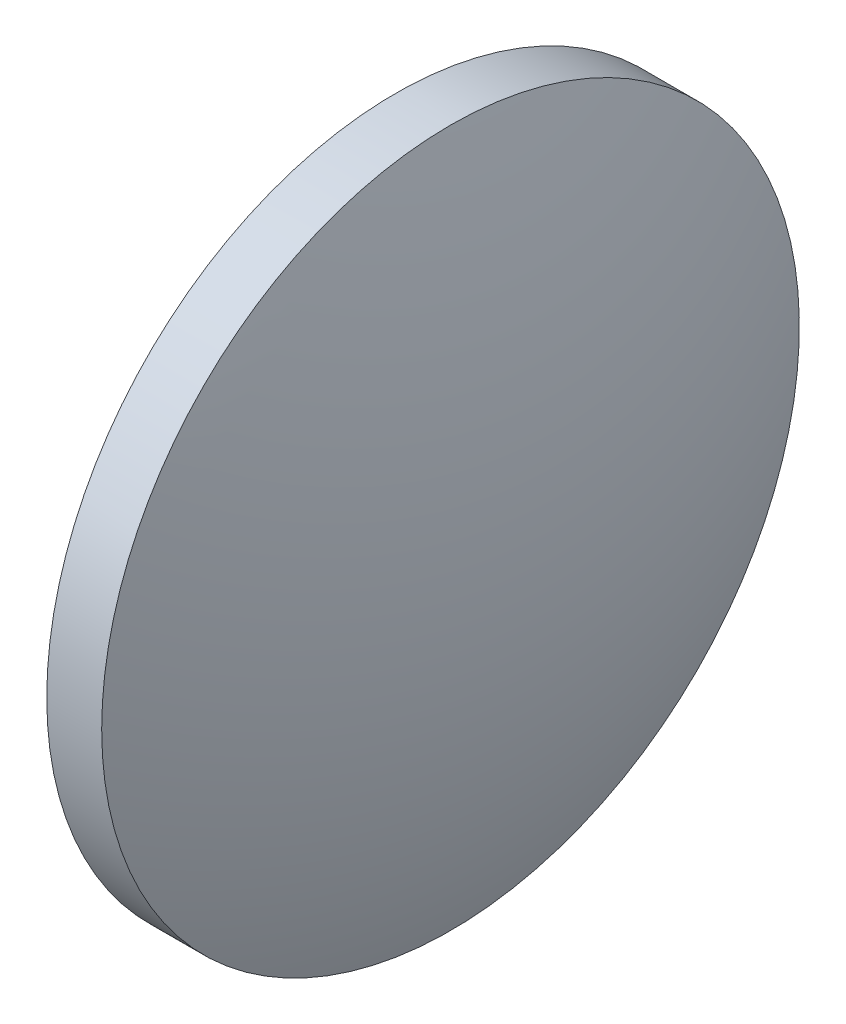
ISO-10303-21;
HEADER;
FILE_DESCRIPTION(('STEP AP214'),'2;1');
FILE_NAME('part.step','',(''),(''),'','','');
FILE_SCHEMA(('AUTOMOTIVE_DESIGN { 1 0 10303 214 1 1 1 1 }'));
ENDSEC;
DATA;
#1=APPLICATION_CONTEXT('core data for automotive mechanical design processes');
#2=APPLICATION_PROTOCOL_DEFINITION('international standard','automotive_design',2000,#1);
#3=PRODUCT_CONTEXT('',#1,'mechanical');
#4=PRODUCT('Part','Part','',(#3));
#5=PRODUCT_RELATED_PRODUCT_CATEGORY('part','',(#4));
#6=PRODUCT_DEFINITION_FORMATION('','',#4);
#7=PRODUCT_DEFINITION_CONTEXT('part definition',#1,'design');
#8=PRODUCT_DEFINITION('design','',#6,#7);
#9=PRODUCT_DEFINITION_SHAPE('','',#8);
#10=(LENGTH_UNIT() NAMED_UNIT(*) SI_UNIT(.MILLI.,.METRE.));
#11=(NAMED_UNIT(*) PLANE_ANGLE_UNIT() SI_UNIT($,.RADIAN.));
#12=(NAMED_UNIT(*) SI_UNIT($,.STERADIAN.) SOLID_ANGLE_UNIT());
#13=UNCERTAINTY_MEASURE_WITH_UNIT(LENGTH_MEASURE(1.E-05),#10,'distance_accuracy_value','');
#14=(GEOMETRIC_REPRESENTATION_CONTEXT(3) GLOBAL_UNCERTAINTY_ASSIGNED_CONTEXT((#13)) GLOBAL_UNIT_ASSIGNED_CONTEXT((#10,
#11,#12)) REPRESENTATION_CONTEXT('',''));
#15=CARTESIAN_POINT('',(0.,0.,0.));
#16=DIRECTION('',(0.,0.,1.));
#17=DIRECTION('',(1.,0.,0.));
#18=AXIS2_PLACEMENT_3D('',#15,#16,#17);
#19=CARTESIAN_POINT('',(521.377021174329,132.59316259993,0.));
#20=DIRECTION('',(-1.,0.,0.));
#21=DIRECTION('',(0.,1.,0.));
#22=AXIS2_PLACEMENT_3D('',#19,#20,#21);
#23=SPHERICAL_SURFACE('',#22,34.2712295081967);
#24=CARTESIAN_POINT('',(553.208250682525,132.59316259993,0.));
#25=DIRECTION('',(-1.,0.,0.));
#26=DIRECTION('',(0.,0.,1.));
#27=AXIS2_PLACEMENT_3D('',#24,#25,#26);
#28=CIRCLE('',#27,12.7);
#29=CARTESIAN_POINT('',(553.208250682525,132.59316259993,12.7));
#30=VERTEX_POINT('',#29);
#31=EDGE_CURVE('E10',#30,#30,#28,.T.);
#32=ORIENTED_EDGE('',*,*,#31,.F.);
#33=EDGE_LOOP('',(#32));
#34=FACE_BOUND('',#33,.T.);
#35=ADVANCED_FACE('F35',(#34),#23,.T.);
#36=CARTESIAN_POINT('',(545.503577135071,132.59316259993,0.));
#37=DIRECTION('',(-1.,0.,0.));
#38=DIRECTION('',(0.,0.,1.));
#39=AXIS2_PLACEMENT_3D('',#36,#37,#38);
#40=CYLINDRICAL_SURFACE('',#39,12.7);
#41=CARTESIAN_POINT('',(551.208250682525,132.59316259993,0.));
#42=DIRECTION('',(-1.,0.,0.));
#43=DIRECTION('',(0.,0.,1.));
#44=AXIS2_PLACEMENT_3D('',#41,#42,#43);
#45=CIRCLE('',#44,12.7);
#46=CARTESIAN_POINT('',(551.208250682525,132.59316259993,12.7));
#47=VERTEX_POINT('',#46);
#48=EDGE_CURVE('E41',#47,#47,#45,.T.);
#49=ORIENTED_EDGE('',*,*,#48,.F.);
#50=EDGE_LOOP('',(#49));
#51=FACE_BOUND('',#50,.T.);
#52=ORIENTED_EDGE('',*,*,#31,.T.);
#53=EDGE_LOOP('',(#52));
#54=FACE_BOUND('',#53,.T.);
#55=ADVANCED_FACE('F49',(#51,#54),#40,.T.);
#56=CARTESIAN_POINT('',(551.208250682525,132.59316259993,0.));
#57=DIRECTION('',(1.,0.,0.));
#58=DIRECTION('',(0.,0.,-1.));
#59=AXIS2_PLACEMENT_3D('',#56,#57,#58);
#60=PLANE('',#59);
#61=ORIENTED_EDGE('',*,*,#48,.T.);
#62=EDGE_LOOP('',(#61));
#63=FACE_BOUND('',#62,.T.);
#64=ADVANCED_FACE('F47',(#63),#60,.F.);
#65=CLOSED_SHELL('',(#35,#55,#64));
#66=MANIFOLD_SOLID_BREP('B2',#65);
#67=ADVANCED_BREP_SHAPE_REPRESENTATION('',(#18,#66),#14);
#68=SHAPE_DEFINITION_REPRESENTATION(#9,#67);
ENDSEC;
END-ISO-10303-21;
